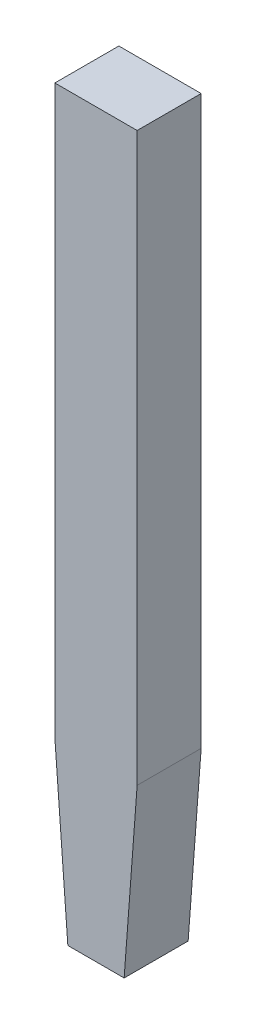
ISO-10303-21;
HEADER;
FILE_DESCRIPTION(('STEP AP214'),'2;1');
FILE_NAME('part.step','',(''),(''),'','','');
FILE_SCHEMA(('AUTOMOTIVE_DESIGN { 1 0 10303 214 1 1 1 1 }'));
ENDSEC;
DATA;
#1=APPLICATION_CONTEXT('core data for automotive mechanical design processes');
#2=APPLICATION_PROTOCOL_DEFINITION('international standard','automotive_design',2000,#1);
#3=PRODUCT_CONTEXT('',#1,'mechanical');
#4=PRODUCT('Part','Part','',(#3));
#5=PRODUCT_RELATED_PRODUCT_CATEGORY('part','',(#4));
#6=PRODUCT_DEFINITION_FORMATION('','',#4);
#7=PRODUCT_DEFINITION_CONTEXT('part definition',#1,'design');
#8=PRODUCT_DEFINITION('design','',#6,#7);
#9=PRODUCT_DEFINITION_SHAPE('','',#8);
#10=(LENGTH_UNIT() NAMED_UNIT(*) SI_UNIT(.MILLI.,.METRE.));
#11=(NAMED_UNIT(*) PLANE_ANGLE_UNIT() SI_UNIT($,.RADIAN.));
#12=(NAMED_UNIT(*) SI_UNIT($,.STERADIAN.) SOLID_ANGLE_UNIT());
#13=UNCERTAINTY_MEASURE_WITH_UNIT(LENGTH_MEASURE(1.E-05),#10,'distance_accuracy_value','');
#14=(GEOMETRIC_REPRESENTATION_CONTEXT(3) GLOBAL_UNCERTAINTY_ASSIGNED_CONTEXT((#13)) GLOBAL_UNIT_ASSIGNED_CONTEXT((#10,
#11,#12)) REPRESENTATION_CONTEXT('',''));
#15=CARTESIAN_POINT('',(0.,0.,0.));
#16=DIRECTION('',(0.,0.,1.));
#17=DIRECTION('',(1.,0.,0.));
#18=AXIS2_PLACEMENT_3D('',#15,#16,#17);
#19=CARTESIAN_POINT('',(52.95457889831,1.696835055312,3.705000000046));
#20=DIRECTION('',(0.,0.,1.));
#21=DIRECTION('',(1.,0.,0.));
#22=AXIS2_PLACEMENT_3D('',#19,#20,#21);
#23=PLANE('',#22);
#24=DIRECTION('',(1.,0.,0.));
#25=VECTOR('',#24,1.);
#26=CARTESIAN_POINT('',(38.93957889831,-15.17126218978,3.705000000046));
#27=LINE('',#26,#25);
#28=CARTESIAN_POINT('',(54.5206861916904,-15.17126218978,3.705000000046));
#29=VERTEX_POINT('',#28);
#30=CARTESIAN_POINT('',(54.8284716049296,-15.17126218978,3.705000000046));
#31=VERTEX_POINT('',#30);
#32=EDGE_CURVE('E94',#29,#31,#27,.T.);
#33=ORIENTED_EDGE('',*,*,#32,.T.);
#34=DIRECTION('',(0.0747899482416168,0.997199309888458,0.));
#35=VECTOR('',#34,1.);
#36=CARTESIAN_POINT('',(54.89957889831,-14.22316494469,3.705000000046));
#37=LINE('',#36,#35);
#38=CARTESIAN_POINT('',(54.89957889831,-14.2231649446899,3.705000000046));
#39=VERTEX_POINT('',#38);
#40=EDGE_CURVE('E98',#39,#31,#37,.F.);
#41=ORIENTED_EDGE('',*,*,#40,.F.);
#42=DIRECTION('',(0.,1.,0.));
#43=VECTOR('',#42,1.);
#44=CARTESIAN_POINT('',(54.89957889831,-10.46816494469,3.705000000046));
#45=LINE('',#44,#43);
#46=CARTESIAN_POINT('',(54.89957889831,-11.12202888849,3.705000000046));
#47=VERTEX_POINT('',#46);
#48=EDGE_CURVE('E83',#47,#39,#45,.F.);
#49=ORIENTED_EDGE('',*,*,#48,.F.);
#50=DIRECTION('',(1.,0.,0.));
#51=VECTOR('',#50,1.);
#52=CARTESIAN_POINT('',(44.47457889831,-11.12202888849,3.705000000046));
#53=LINE('',#52,#51);
#54=CARTESIAN_POINT('',(54.44957889831,-11.12202888849,3.705000000046));
#55=VERTEX_POINT('',#54);
#56=EDGE_CURVE('E20',#47,#55,#53,.F.);
#57=ORIENTED_EDGE('',*,*,#56,.T.);
#58=DIRECTION('',(0.,1.,0.));
#59=VECTOR('',#58,1.);
#60=CARTESIAN_POINT('',(54.44957889831,-10.46816494469,3.705000000046));
#61=LINE('',#60,#59);
#62=CARTESIAN_POINT('',(54.44957889831,-14.2231649446902,3.705000000046));
#63=VERTEX_POINT('',#62);
#64=EDGE_CURVE('E71',#63,#55,#61,.T.);
#65=ORIENTED_EDGE('',*,*,#64,.F.);
#66=DIRECTION('',(0.0747899482416168,-0.997199309888458,0.));
#67=VECTOR('',#66,1.);
#68=CARTESIAN_POINT('',(54.44957889831,-14.22316494469,3.705000000046));
#69=LINE('',#68,#67);
#70=EDGE_CURVE('E66',#29,#63,#69,.F.);
#71=ORIENTED_EDGE('',*,*,#70,.F.);
#72=EDGE_LOOP('',(#33,#41,#49,#57,#65,#71));
#73=FACE_BOUND('',#72,.T.);
#74=ADVANCED_FACE('F17',(#73),#23,.T.);
#75=CARTESIAN_POINT('',(44.47457889831,-11.12202888849,-0.158278306686));
#76=DIRECTION('',(0.,-1.,0.));
#77=DIRECTION('',(0.,0.,-1.));
#78=AXIS2_PLACEMENT_3D('',#75,#76,#77);
#79=PLANE('',#78);
#80=DIRECTION('',(1.,0.,0.));
#81=VECTOR('',#80,1.);
#82=CARTESIAN_POINT('',(52.95457889831,-11.12202888849,3.355000000046));
#83=LINE('',#82,#81);
#84=CARTESIAN_POINT('',(54.89957889831,-11.12202888849,3.355000000046));
#85=VERTEX_POINT('',#84);
#86=CARTESIAN_POINT('',(54.44957889831,-11.12202888849,3.355000000046));
#87=VERTEX_POINT('',#86);
#88=EDGE_CURVE('E89',#85,#87,#83,.F.);
#89=ORIENTED_EDGE('',*,*,#88,.T.);
#90=DIRECTION('',(0.,0.,1.));
#91=VECTOR('',#90,1.);
#92=CARTESIAN_POINT('',(54.44957889831,-11.12202888849,3.355000000046));
#93=LINE('',#92,#91);
#94=EDGE_CURVE('E76',#55,#87,#93,.F.);
#95=ORIENTED_EDGE('',*,*,#94,.F.);
#96=ORIENTED_EDGE('',*,*,#56,.F.);
#97=DIRECTION('',(0.,0.,-1.));
#98=VECTOR('',#97,1.);
#99=CARTESIAN_POINT('',(54.89957889831,-11.12202888849,3.355000000046));
#100=LINE('',#99,#98);
#101=EDGE_CURVE('E102',#85,#47,#100,.F.);
#102=ORIENTED_EDGE('',*,*,#101,.F.);
#103=EDGE_LOOP('',(#89,#95,#96,#102));
#104=FACE_BOUND('',#103,.T.);
#105=ADVANCED_FACE('F88',(#104),#79,.F.);
#106=CARTESIAN_POINT('',(54.44957889831,-10.46816494469,3.355000000046));
#107=DIRECTION('',(-1.,0.,0.));
#108=DIRECTION('',(0.,0.,1.));
#109=AXIS2_PLACEMENT_3D('',#106,#107,#108);
#110=PLANE('',#109);
#111=DIRECTION('',(0.,1.,0.));
#112=VECTOR('',#111,1.);
#113=CARTESIAN_POINT('',(54.44957889831,1.696835055312,3.355000000046));
#114=LINE('',#113,#112);
#115=CARTESIAN_POINT('',(54.44957889831,-14.2231649446901,3.355000000046));
#116=VERTEX_POINT('',#115);
#117=EDGE_CURVE('E107',#87,#116,#114,.F.);
#118=ORIENTED_EDGE('',*,*,#117,.T.);
#119=DIRECTION('',(0.,0.,1.));
#120=VECTOR('',#119,1.);
#121=CARTESIAN_POINT('',(54.44957889831,-14.22316494469,3.355000000046));
#122=LINE('',#121,#120);
#123=EDGE_CURVE('E78',#63,#116,#122,.F.);
#124=ORIENTED_EDGE('',*,*,#123,.F.);
#125=ORIENTED_EDGE('',*,*,#64,.T.);
#126=ORIENTED_EDGE('',*,*,#94,.T.);
#127=EDGE_LOOP('',(#118,#124,#125,#126));
#128=FACE_BOUND('',#127,.T.);
#129=ADVANCED_FACE('F74',(#128),#110,.T.);
#130=CARTESIAN_POINT('',(54.44957889831,-14.22316494469,3.355000000046));
#131=DIRECTION('',(-0.997199309888458,-0.0747899482416168,0.));
#132=DIRECTION('',(0.0747899482416168,-0.997199309888458,0.));
#133=AXIS2_PLACEMENT_3D('',#130,#131,#132);
#134=PLANE('',#133);
#135=ORIENTED_EDGE('',*,*,#70,.T.);
#136=ORIENTED_EDGE('',*,*,#123,.T.);
#137=DIRECTION('',(0.0747899482397982,-0.997199309888594,0.));
#138=VECTOR('',#137,1.);
#139=CARTESIAN_POINT('',(54.44957889831,-14.22316494469,3.355000000046));
#140=LINE('',#139,#138);
#141=CARTESIAN_POINT('',(54.5206861916909,-15.1712621897799,3.355000000046));
#142=VERTEX_POINT('',#141);
#143=EDGE_CURVE('E109',#116,#142,#140,.T.);
#144=ORIENTED_EDGE('',*,*,#143,.T.);
#145=DIRECTION('',(0.,0.,1.));
#146=VECTOR('',#145,1.);
#147=CARTESIAN_POINT('',(54.52068619169,-15.17126218978,-0.8137967800219));
#148=LINE('',#147,#146);
#149=EDGE_CURVE('E96',#142,#29,#148,.T.);
#150=ORIENTED_EDGE('',*,*,#149,.T.);
#151=EDGE_LOOP('',(#135,#136,#144,#150));
#152=FACE_BOUND('',#151,.T.);
#153=ADVANCED_FACE('F126',(#152),#134,.T.);
#154=CARTESIAN_POINT('',(38.93957889831,-15.17126218978,-0.8137967800219));
#155=DIRECTION('',(0.,1.,0.));
#156=DIRECTION('',(0.,0.,1.));
#157=AXIS2_PLACEMENT_3D('',#154,#155,#156);
#158=PLANE('',#157);
#159=DIRECTION('',(1.,0.,0.));
#160=VECTOR('',#159,1.);
#161=CARTESIAN_POINT('',(52.95457889831,-15.17126218978,3.355000000046));
#162=LINE('',#161,#160);
#163=CARTESIAN_POINT('',(54.8284716049296,-15.17126218978,3.355000000046));
#164=VERTEX_POINT('',#163);
#165=EDGE_CURVE('E112',#142,#164,#162,.T.);
#166=ORIENTED_EDGE('',*,*,#165,.T.);
#167=DIRECTION('',(0.,0.,1.));
#168=VECTOR('',#167,1.);
#169=CARTESIAN_POINT('',(54.8284716049283,-15.1712621897799,3.355000000046));
#170=LINE('',#169,#168);
#171=EDGE_CURVE('E100',#31,#164,#170,.F.);
#172=ORIENTED_EDGE('',*,*,#171,.F.);
#173=ORIENTED_EDGE('',*,*,#32,.F.);
#174=ORIENTED_EDGE('',*,*,#149,.F.);
#175=EDGE_LOOP('',(#166,#172,#173,#174));
#176=FACE_BOUND('',#175,.T.);
#177=ADVANCED_FACE('F125',(#176),#158,.F.);
#178=CARTESIAN_POINT('',(54.89957889831,-14.22316494469,3.355000000046));
#179=DIRECTION('',(0.997199309888458,-0.0747899482416168,0.));
#180=DIRECTION('',(0.0747899482416168,0.997199309888458,0.));
#181=AXIS2_PLACEMENT_3D('',#178,#179,#180);
#182=PLANE('',#181);
#183=DIRECTION('',(0.0747899482397982,0.997199309888594,0.));
#184=VECTOR('',#183,1.);
#185=CARTESIAN_POINT('',(54.82847160493,-15.17126218978,3.355000000046));
#186=LINE('',#185,#184);
#187=CARTESIAN_POINT('',(54.89957889831,-14.22316494469,3.355000000046));
#188=VERTEX_POINT('',#187);
#189=EDGE_CURVE('E26',#164,#188,#186,.T.);
#190=ORIENTED_EDGE('',*,*,#189,.T.);
#191=DIRECTION('',(0.,0.,-1.));
#192=VECTOR('',#191,1.);
#193=CARTESIAN_POINT('',(54.89957889831,-14.22316494469,3.355000000046));
#194=LINE('',#193,#192);
#195=EDGE_CURVE('E34',#39,#188,#194,.T.);
#196=ORIENTED_EDGE('',*,*,#195,.F.);
#197=ORIENTED_EDGE('',*,*,#40,.T.);
#198=ORIENTED_EDGE('',*,*,#171,.T.);
#199=EDGE_LOOP('',(#190,#196,#197,#198));
#200=FACE_BOUND('',#199,.T.);
#201=ADVANCED_FACE('F118',(#200),#182,.T.);
#202=CARTESIAN_POINT('',(54.89957889831,-10.46816494469,3.355000000046));
#203=DIRECTION('',(1.,0.,0.));
#204=DIRECTION('',(0.,0.,-1.));
#205=AXIS2_PLACEMENT_3D('',#202,#203,#204);
#206=PLANE('',#205);
#207=ORIENTED_EDGE('',*,*,#48,.T.);
#208=ORIENTED_EDGE('',*,*,#195,.T.);
#209=DIRECTION('',(0.,1.,0.));
#210=VECTOR('',#209,1.);
#211=CARTESIAN_POINT('',(54.89957889831,1.696835055312,3.355000000046));
#212=LINE('',#211,#210);
#213=EDGE_CURVE('E11',#188,#85,#212,.T.);
#214=ORIENTED_EDGE('',*,*,#213,.T.);
#215=ORIENTED_EDGE('',*,*,#101,.T.);
#216=EDGE_LOOP('',(#207,#208,#214,#215));
#217=FACE_BOUND('',#216,.T.);
#218=ADVANCED_FACE('F127',(#217),#206,.T.);
#219=CARTESIAN_POINT('',(52.95457889831,1.696835055312,3.355000000046));
#220=DIRECTION('',(0.,0.,1.));
#221=DIRECTION('',(1.,0.,0.));
#222=AXIS2_PLACEMENT_3D('',#219,#220,#221);
#223=PLANE('',#222);
#224=ORIENTED_EDGE('',*,*,#189,.F.);
#225=ORIENTED_EDGE('',*,*,#165,.F.);
#226=ORIENTED_EDGE('',*,*,#143,.F.);
#227=ORIENTED_EDGE('',*,*,#117,.F.);
#228=ORIENTED_EDGE('',*,*,#88,.F.);
#229=ORIENTED_EDGE('',*,*,#213,.F.);
#230=EDGE_LOOP('',(#224,#225,#226,#227,#228,#229));
#231=FACE_BOUND('',#230,.T.);
#232=ADVANCED_FACE('F122',(#231),#223,.F.);
#233=CLOSED_SHELL('',(#74,#105,#129,#153,#177,#201,#218,#232));
#234=MANIFOLD_SOLID_BREP('B1',#233);
#235=ADVANCED_BREP_SHAPE_REPRESENTATION('',(#18,#234),#14);
#236=SHAPE_DEFINITION_REPRESENTATION(#9,#235);
ENDSEC;
END-ISO-10303-21;
